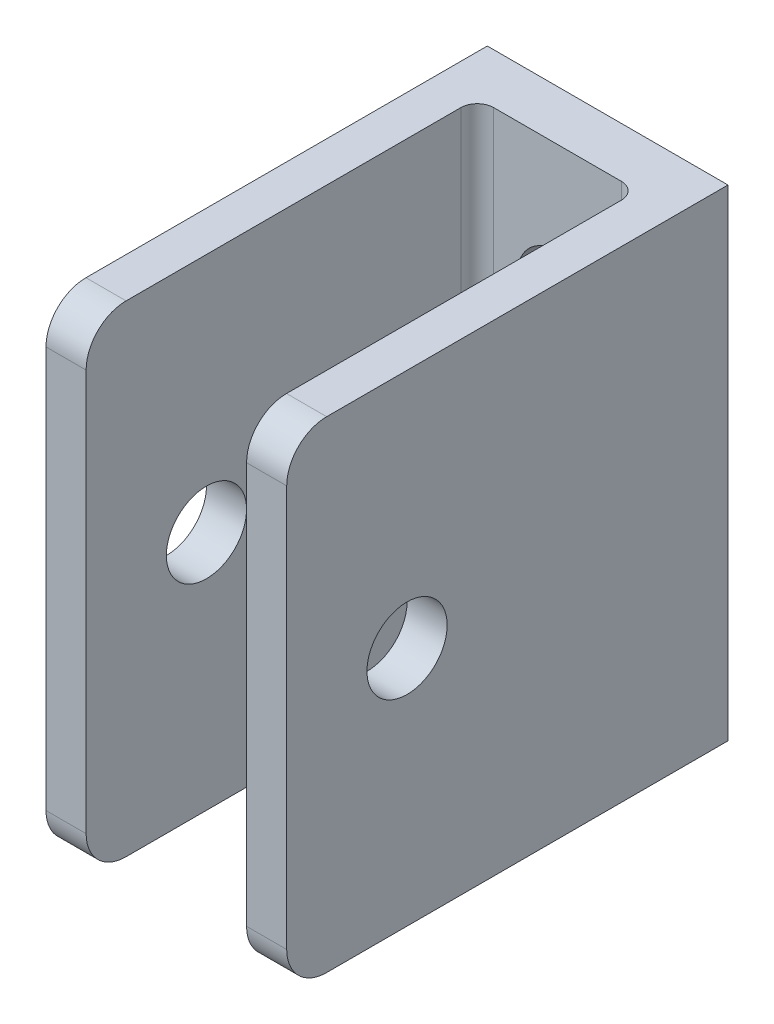
ISO-10303-21;
HEADER;
FILE_DESCRIPTION(('STEP AP214'),'2;1');
FILE_NAME('part.step','',(''),(''),'','','');
FILE_SCHEMA(('AUTOMOTIVE_DESIGN { 1 0 10303 214 1 1 1 1 }'));
ENDSEC;
DATA;
#1=APPLICATION_CONTEXT('core data for automotive mechanical design processes');
#2=APPLICATION_PROTOCOL_DEFINITION('international standard','automotive_design',2000,#1);
#3=PRODUCT_CONTEXT('',#1,'mechanical');
#4=PRODUCT('Part','Part','',(#3));
#5=PRODUCT_RELATED_PRODUCT_CATEGORY('part','',(#4));
#6=PRODUCT_DEFINITION_FORMATION('','',#4);
#7=PRODUCT_DEFINITION_CONTEXT('part definition',#1,'design');
#8=PRODUCT_DEFINITION('design','',#6,#7);
#9=PRODUCT_DEFINITION_SHAPE('','',#8);
#10=(LENGTH_UNIT() NAMED_UNIT(*) SI_UNIT(.MILLI.,.METRE.));
#11=(NAMED_UNIT(*) PLANE_ANGLE_UNIT() SI_UNIT($,.RADIAN.));
#12=(NAMED_UNIT(*) SI_UNIT($,.STERADIAN.) SOLID_ANGLE_UNIT());
#13=UNCERTAINTY_MEASURE_WITH_UNIT(LENGTH_MEASURE(1.E-05),#10,'distance_accuracy_value','');
#14=(GEOMETRIC_REPRESENTATION_CONTEXT(3) GLOBAL_UNCERTAINTY_ASSIGNED_CONTEXT((#13)) GLOBAL_UNIT_ASSIGNED_CONTEXT((#10,
#11,#12)) REPRESENTATION_CONTEXT('',''));
#15=CARTESIAN_POINT('',(0.,0.,0.));
#16=DIRECTION('',(0.,0.,1.));
#17=DIRECTION('',(1.,0.,0.));
#18=AXIS2_PLACEMENT_3D('',#15,#16,#17);
#19=CARTESIAN_POINT('',(9.525,19.05,0.));
#20=DIRECTION('',(-1.,0.,0.));
#21=DIRECTION('',(0.,0.,1.));
#22=AXIS2_PLACEMENT_3D('',#19,#20,#21);
#23=PLANE('',#22);
#24=DIRECTION('',(0.,-1.,0.));
#25=VECTOR('',#24,1.);
#26=CARTESIAN_POINT('',(9.525,19.05,34.925));
#27=LINE('',#26,#25);
#28=CARTESIAN_POINT('',(9.525,15.8877,34.925));
#29=VERTEX_POINT('',#28);
#30=CARTESIAN_POINT('',(9.525,-15.8877,34.925));
#31=VERTEX_POINT('',#30);
#32=EDGE_CURVE('E241',#29,#31,#27,.T.);
#33=ORIENTED_EDGE('',*,*,#32,.T.);
#34=CARTESIAN_POINT('',(9.525,-15.8877,31.7627));
#35=DIRECTION('',(-1.,0.,0.));
#36=DIRECTION('',(0.,0.,1.));
#37=AXIS2_PLACEMENT_3D('',#34,#35,#36);
#38=CIRCLE('',#37,3.1623);
#39=CARTESIAN_POINT('',(9.525,-19.05,31.7627));
#40=VERTEX_POINT('',#39);
#41=EDGE_CURVE('E186',#31,#40,#38,.F.);
#42=ORIENTED_EDGE('',*,*,#41,.T.);
#43=DIRECTION('',(0.,0.,-1.));
#44=VECTOR('',#43,1.);
#45=CARTESIAN_POINT('',(9.525,-19.05,0.));
#46=LINE('',#45,#44);
#47=CARTESIAN_POINT('',(9.525,-19.05,0.));
#48=VERTEX_POINT('',#47);
#49=EDGE_CURVE('E159',#40,#48,#46,.T.);
#50=ORIENTED_EDGE('',*,*,#49,.T.);
#51=DIRECTION('',(0.,-1.,0.));
#52=VECTOR('',#51,1.);
#53=CARTESIAN_POINT('',(9.525,19.05,0.));
#54=LINE('',#53,#52);
#55=CARTESIAN_POINT('',(9.525,19.05,0.));
#56=VERTEX_POINT('',#55);
#57=EDGE_CURVE('E150',#56,#48,#54,.T.);
#58=ORIENTED_EDGE('',*,*,#57,.F.);
#59=DIRECTION('',(0.,0.,-1.));
#60=VECTOR('',#59,1.);
#61=CARTESIAN_POINT('',(9.525,19.05,0.));
#62=LINE('',#61,#60);
#63=CARTESIAN_POINT('',(9.525,19.05,31.7627));
#64=VERTEX_POINT('',#63);
#65=EDGE_CURVE('E133',#64,#56,#62,.T.);
#66=ORIENTED_EDGE('',*,*,#65,.F.);
#67=CARTESIAN_POINT('',(9.525,15.8877,31.7627));
#68=DIRECTION('',(-1.,0.,0.));
#69=DIRECTION('',(0.,0.,1.));
#70=AXIS2_PLACEMENT_3D('',#67,#68,#69);
#71=CIRCLE('',#70,3.1623);
#72=EDGE_CURVE('E184',#64,#29,#71,.F.);
#73=ORIENTED_EDGE('',*,*,#72,.T.);
#74=EDGE_LOOP('',(#33,#42,#50,#58,#66,#73));
#75=FACE_BOUND('',#74,.T.);
#76=CARTESIAN_POINT('',(9.525,0.,25.4));
#77=DIRECTION('',(1.,0.,0.));
#78=DIRECTION('',(0.,0.,-1.));
#79=AXIS2_PLACEMENT_3D('',#76,#77,#78);
#80=CIRCLE('',#79,3.175);
#81=CARTESIAN_POINT('',(9.525,0.,22.225));
#82=VERTEX_POINT('',#81);
#83=EDGE_CURVE('E180',#82,#82,#80,.T.);
#84=ORIENTED_EDGE('',*,*,#83,.F.);
#85=EDGE_LOOP('',(#84));
#86=FACE_BOUND('',#85,.T.);
#87=ADVANCED_FACE('F32',(#75,#86),#23,.F.);
#88=CARTESIAN_POINT('',(-9.52499999999999,19.05,34.925));
#89=DIRECTION('',(1.,0.,0.));
#90=DIRECTION('',(0.,0.,-1.));
#91=AXIS2_PLACEMENT_3D('',#88,#89,#90);
#92=PLANE('',#91);
#93=DIRECTION('',(0.,0.,1.));
#94=VECTOR('',#93,1.);
#95=CARTESIAN_POINT('',(-9.52499999999999,-19.05,34.925));
#96=LINE('',#95,#94);
#97=CARTESIAN_POINT('',(-9.525,-19.05,0.));
#98=VERTEX_POINT('',#97);
#99=CARTESIAN_POINT('',(-9.52499999999999,-19.05,31.7627));
#100=VERTEX_POINT('',#99);
#101=EDGE_CURVE('E254',#98,#100,#96,.T.);
#102=ORIENTED_EDGE('',*,*,#101,.T.);
#103=CARTESIAN_POINT('',(-9.52499999999999,-15.8877,31.7627));
#104=DIRECTION('',(1.,0.,0.));
#105=DIRECTION('',(0.,0.,-1.));
#106=AXIS2_PLACEMENT_3D('',#103,#104,#105);
#107=CIRCLE('',#106,3.1623);
#108=CARTESIAN_POINT('',(-9.52499999999999,-15.8877,34.925));
#109=VERTEX_POINT('',#108);
#110=EDGE_CURVE('E213',#100,#109,#107,.F.);
#111=ORIENTED_EDGE('',*,*,#110,.T.);
#112=DIRECTION('',(0.,-1.,0.));
#113=VECTOR('',#112,1.);
#114=CARTESIAN_POINT('',(-9.52499999999999,19.05,34.925));
#115=LINE('',#114,#113);
#116=CARTESIAN_POINT('',(-9.52499999999999,15.8877,34.925));
#117=VERTEX_POINT('',#116);
#118=EDGE_CURVE('E165',#117,#109,#115,.T.);
#119=ORIENTED_EDGE('',*,*,#118,.F.);
#120=CARTESIAN_POINT('',(-9.52499999999999,15.8877,31.7627));
#121=DIRECTION('',(1.,0.,0.));
#122=DIRECTION('',(0.,0.,-1.));
#123=AXIS2_PLACEMENT_3D('',#120,#121,#122);
#124=CIRCLE('',#123,3.1623);
#125=CARTESIAN_POINT('',(-9.52499999999999,19.05,31.7627));
#126=VERTEX_POINT('',#125);
#127=EDGE_CURVE('E211',#117,#126,#124,.F.);
#128=ORIENTED_EDGE('',*,*,#127,.T.);
#129=DIRECTION('',(0.,0.,1.));
#130=VECTOR('',#129,1.);
#131=CARTESIAN_POINT('',(-9.52499999999999,19.05,34.925));
#132=LINE('',#131,#130);
#133=CARTESIAN_POINT('',(-9.525,19.05,0.));
#134=VERTEX_POINT('',#133);
#135=EDGE_CURVE('E154',#134,#126,#132,.T.);
#136=ORIENTED_EDGE('',*,*,#135,.F.);
#137=DIRECTION('',(0.,-1.,0.));
#138=VECTOR('',#137,1.);
#139=CARTESIAN_POINT('',(-9.525,19.05,0.));
#140=LINE('',#139,#138);
#141=EDGE_CURVE('E152',#134,#98,#140,.T.);
#142=ORIENTED_EDGE('',*,*,#141,.T.);
#143=EDGE_LOOP('',(#102,#111,#119,#128,#136,#142));
#144=FACE_BOUND('',#143,.T.);
#145=CARTESIAN_POINT('',(-9.525,0.,25.4));
#146=DIRECTION('',(1.,0.,0.));
#147=DIRECTION('',(0.,0.,-1.));
#148=AXIS2_PLACEMENT_3D('',#145,#146,#147);
#149=CIRCLE('',#148,3.175);
#150=CARTESIAN_POINT('',(-9.525,0.,22.225));
#151=VERTEX_POINT('',#150);
#152=EDGE_CURVE('E299',#151,#151,#149,.T.);
#153=ORIENTED_EDGE('',*,*,#152,.T.);
#154=EDGE_LOOP('',(#153));
#155=FACE_BOUND('',#154,.T.);
#156=ADVANCED_FACE('F281',(#144,#155),#92,.F.);
#157=CARTESIAN_POINT('',(-6.35,19.05,3.96875));
#158=DIRECTION('',(-1.,0.,0.));
#159=DIRECTION('',(0.,0.,1.));
#160=AXIS2_PLACEMENT_3D('',#157,#158,#159);
#161=PLANE('',#160);
#162=DIRECTION('',(0.,0.,-1.));
#163=VECTOR('',#162,1.);
#164=CARTESIAN_POINT('',(-6.35,-19.05,3.96875));
#165=LINE('',#164,#163);
#166=CARTESIAN_POINT('',(-6.34999999999999,-19.05,31.7627));
#167=VERTEX_POINT('',#166);
#168=CARTESIAN_POINT('',(-6.35,-19.05,5.2705));
#169=VERTEX_POINT('',#168);
#170=EDGE_CURVE('E251',#167,#169,#165,.T.);
#171=ORIENTED_EDGE('',*,*,#170,.T.);
#172=DIRECTION('',(0.,-1.,0.));
#173=VECTOR('',#172,1.);
#174=CARTESIAN_POINT('',(-6.35,19.05,5.2705));
#175=LINE('',#174,#173);
#176=CARTESIAN_POINT('',(-6.35,19.05,5.2705));
#177=VERTEX_POINT('',#176);
#178=EDGE_CURVE('E47',#169,#177,#175,.F.);
#179=ORIENTED_EDGE('',*,*,#178,.T.);
#180=DIRECTION('',(0.,0.,-1.));
#181=VECTOR('',#180,1.);
#182=CARTESIAN_POINT('',(-6.35,19.05,3.96875));
#183=LINE('',#182,#181);
#184=CARTESIAN_POINT('',(-6.34999999999999,19.05,31.7627));
#185=VERTEX_POINT('',#184);
#186=EDGE_CURVE('E288',#185,#177,#183,.T.);
#187=ORIENTED_EDGE('',*,*,#186,.F.);
#188=CARTESIAN_POINT('',(-6.34999999999999,15.8877,31.7627));
#189=DIRECTION('',(-1.,0.,0.));
#190=DIRECTION('',(0.,0.,1.));
#191=AXIS2_PLACEMENT_3D('',#188,#189,#190);
#192=CIRCLE('',#191,3.1623);
#193=CARTESIAN_POINT('',(-6.34999999999999,15.8877,34.925));
#194=VERTEX_POINT('',#193);
#195=EDGE_CURVE('E207',#185,#194,#192,.F.);
#196=ORIENTED_EDGE('',*,*,#195,.T.);
#197=DIRECTION('',(0.,-1.,0.));
#198=VECTOR('',#197,1.);
#199=CARTESIAN_POINT('',(-6.34999999999999,19.05,34.925));
#200=LINE('',#199,#198);
#201=CARTESIAN_POINT('',(-6.34999999999999,-15.8877,34.925));
#202=VERTEX_POINT('',#201);
#203=EDGE_CURVE('E262',#194,#202,#200,.T.);
#204=ORIENTED_EDGE('',*,*,#203,.T.);
#205=CARTESIAN_POINT('',(-6.34999999999999,-15.8877,31.7627));
#206=DIRECTION('',(-1.,0.,0.));
#207=DIRECTION('',(0.,0.,1.));
#208=AXIS2_PLACEMENT_3D('',#205,#206,#207);
#209=CIRCLE('',#208,3.1623);
#210=EDGE_CURVE('E209',#202,#167,#209,.F.);
#211=ORIENTED_EDGE('',*,*,#210,.T.);
#212=EDGE_LOOP('',(#171,#179,#187,#196,#204,#211));
#213=FACE_BOUND('',#212,.T.);
#214=CARTESIAN_POINT('',(-6.34999999999999,0.,25.4));
#215=DIRECTION('',(-1.,0.,0.));
#216=DIRECTION('',(0.,0.,1.));
#217=AXIS2_PLACEMENT_3D('',#214,#215,#216);
#218=CIRCLE('',#217,3.175);
#219=CARTESIAN_POINT('',(-6.34999999999999,0.,28.575));
#220=VERTEX_POINT('',#219);
#221=EDGE_CURVE('E179',#220,#220,#218,.F.);
#222=ORIENTED_EDGE('',*,*,#221,.F.);
#223=EDGE_LOOP('',(#222));
#224=FACE_BOUND('',#223,.T.);
#225=ADVANCED_FACE('F277',(#213,#224),#161,.F.);
#226=CARTESIAN_POINT('',(6.34999999999999,19.05,34.925));
#227=DIRECTION('',(1.,0.,0.));
#228=DIRECTION('',(0.,0.,-1.));
#229=AXIS2_PLACEMENT_3D('',#226,#227,#228);
#230=PLANE('',#229);
#231=DIRECTION('',(0.,0.,1.));
#232=VECTOR('',#231,1.);
#233=CARTESIAN_POINT('',(6.34999999999999,19.05,34.925));
#234=LINE('',#233,#232);
#235=CARTESIAN_POINT('',(6.35,19.05,5.2705));
#236=VERTEX_POINT('',#235);
#237=CARTESIAN_POINT('',(6.34999999999999,19.05,31.7627));
#238=VERTEX_POINT('',#237);
#239=EDGE_CURVE('E229',#236,#238,#234,.T.);
#240=ORIENTED_EDGE('',*,*,#239,.F.);
#241=DIRECTION('',(0.,-1.,0.));
#242=VECTOR('',#241,1.);
#243=CARTESIAN_POINT('',(6.35,-19.05,5.2705));
#244=LINE('',#243,#242);
#245=CARTESIAN_POINT('',(6.35,-19.05,5.2705));
#246=VERTEX_POINT('',#245);
#247=EDGE_CURVE('E215',#236,#246,#244,.T.);
#248=ORIENTED_EDGE('',*,*,#247,.T.);
#249=DIRECTION('',(0.,0.,1.));
#250=VECTOR('',#249,1.);
#251=CARTESIAN_POINT('',(6.34999999999999,-19.05,34.925));
#252=LINE('',#251,#250);
#253=CARTESIAN_POINT('',(6.34999999999999,-19.05,31.7627));
#254=VERTEX_POINT('',#253);
#255=EDGE_CURVE('E144',#246,#254,#252,.T.);
#256=ORIENTED_EDGE('',*,*,#255,.T.);
#257=CARTESIAN_POINT('',(6.34999999999999,-15.8877,31.7627));
#258=DIRECTION('',(1.,0.,0.));
#259=DIRECTION('',(0.,0.,-1.));
#260=AXIS2_PLACEMENT_3D('',#257,#258,#259);
#261=CIRCLE('',#260,3.1623);
#262=CARTESIAN_POINT('',(6.34999999999999,-15.8877,34.925));
#263=VERTEX_POINT('',#262);
#264=EDGE_CURVE('E196',#254,#263,#261,.F.);
#265=ORIENTED_EDGE('',*,*,#264,.T.);
#266=DIRECTION('',(0.,-1.,0.));
#267=VECTOR('',#266,1.);
#268=CARTESIAN_POINT('',(6.34999999999999,19.05,34.925));
#269=LINE('',#268,#267);
#270=CARTESIAN_POINT('',(6.34999999999999,15.8877,34.925));
#271=VERTEX_POINT('',#270);
#272=EDGE_CURVE('E259',#271,#263,#269,.T.);
#273=ORIENTED_EDGE('',*,*,#272,.F.);
#274=CARTESIAN_POINT('',(6.34999999999999,15.8877,31.7627));
#275=DIRECTION('',(1.,0.,0.));
#276=DIRECTION('',(0.,0.,-1.));
#277=AXIS2_PLACEMENT_3D('',#274,#275,#276);
#278=CIRCLE('',#277,3.1623);
#279=EDGE_CURVE('E193',#271,#238,#278,.F.);
#280=ORIENTED_EDGE('',*,*,#279,.T.);
#281=EDGE_LOOP('',(#240,#248,#256,#265,#273,#280));
#282=FACE_BOUND('',#281,.T.);
#283=CARTESIAN_POINT('',(6.34999999999999,0.,25.4));
#284=DIRECTION('',(1.,0.,0.));
#285=DIRECTION('',(0.,0.,-1.));
#286=AXIS2_PLACEMENT_3D('',#283,#284,#285);
#287=CIRCLE('',#286,3.175);
#288=CARTESIAN_POINT('',(6.34999999999999,0.,22.225));
#289=VERTEX_POINT('',#288);
#290=EDGE_CURVE('E177',#289,#289,#287,.F.);
#291=ORIENTED_EDGE('',*,*,#290,.F.);
#292=EDGE_LOOP('',(#291));
#293=FACE_BOUND('',#292,.T.);
#294=ADVANCED_FACE('F236',(#282,#293),#230,.F.);
#295=CARTESIAN_POINT('',(-9.525,19.05,0.));
#296=DIRECTION('',(0.,0.,1.));
#297=DIRECTION('',(1.,0.,0.));
#298=AXIS2_PLACEMENT_3D('',#295,#296,#297);
#299=PLANE('',#298);
#300=CARTESIAN_POINT('',(0.,8.5725,0.));
#301=DIRECTION('',(0.,0.,1.));
#302=DIRECTION('',(1.,0.,0.));
#303=AXIS2_PLACEMENT_3D('',#300,#301,#302);
#304=CIRCLE('',#303,3.175);
#305=CARTESIAN_POINT('',(3.175,8.5725,0.));
#306=VERTEX_POINT('',#305);
#307=EDGE_CURVE('E172',#306,#306,#304,.T.);
#308=ORIENTED_EDGE('',*,*,#307,.T.);
#309=EDGE_LOOP('',(#308));
#310=FACE_BOUND('',#309,.T.);
#311=DIRECTION('',(-1.,0.,0.));
#312=VECTOR('',#311,1.);
#313=CARTESIAN_POINT('',(-9.525,-19.05,0.));
#314=LINE('',#313,#312);
#315=EDGE_CURVE('E283',#48,#98,#314,.T.);
#316=ORIENTED_EDGE('',*,*,#315,.T.);
#317=ORIENTED_EDGE('',*,*,#141,.F.);
#318=DIRECTION('',(-1.,0.,0.));
#319=VECTOR('',#318,1.);
#320=CARTESIAN_POINT('',(-9.525,19.05,0.));
#321=LINE('',#320,#319);
#322=EDGE_CURVE('E138',#56,#134,#321,.T.);
#323=ORIENTED_EDGE('',*,*,#322,.F.);
#324=ORIENTED_EDGE('',*,*,#57,.T.);
#325=EDGE_LOOP('',(#316,#317,#323,#324));
#326=FACE_BOUND('',#325,.T.);
#327=CARTESIAN_POINT('',(0.,-8.5725,0.));
#328=DIRECTION('',(0.,0.,1.));
#329=DIRECTION('',(1.,0.,0.));
#330=AXIS2_PLACEMENT_3D('',#327,#328,#329);
#331=CIRCLE('',#330,3.175);
#332=CARTESIAN_POINT('',(3.175,-8.5725,0.));
#333=VERTEX_POINT('',#332);
#334=EDGE_CURVE('E176',#333,#333,#331,.T.);
#335=ORIENTED_EDGE('',*,*,#334,.T.);
#336=EDGE_LOOP('',(#335));
#337=FACE_BOUND('',#336,.T.);
#338=ADVANCED_FACE('F148',(#310,#326,#337),#299,.F.);
#339=CARTESIAN_POINT('',(6.35,19.05,3.96875));
#340=DIRECTION('',(0.,0.,-1.));
#341=DIRECTION('',(-1.,0.,0.));
#342=AXIS2_PLACEMENT_3D('',#339,#340,#341);
#343=PLANE('',#342);
#344=CARTESIAN_POINT('',(0.,8.5725,3.96875));
#345=DIRECTION('',(0.,0.,-1.));
#346=DIRECTION('',(-1.,0.,0.));
#347=AXIS2_PLACEMENT_3D('',#344,#345,#346);
#348=CIRCLE('',#347,3.175);
#349=CARTESIAN_POINT('',(-3.175,8.5725,3.96875));
#350=VERTEX_POINT('',#349);
#351=EDGE_CURVE('E169',#350,#350,#348,.F.);
#352=ORIENTED_EDGE('',*,*,#351,.F.);
#353=EDGE_LOOP('',(#352));
#354=FACE_BOUND('',#353,.T.);
#355=DIRECTION('',(1.,0.,0.));
#356=VECTOR('',#355,1.);
#357=CARTESIAN_POINT('',(6.35,-19.05,3.96875));
#358=LINE('',#357,#356);
#359=CARTESIAN_POINT('',(-5.04825,-19.05,3.96875));
#360=VERTEX_POINT('',#359);
#361=CARTESIAN_POINT('',(5.04825,-19.05,3.96875));
#362=VERTEX_POINT('',#361);
#363=EDGE_CURVE('E246',#360,#362,#358,.T.);
#364=ORIENTED_EDGE('',*,*,#363,.T.);
#365=DIRECTION('',(0.,-1.,0.));
#366=VECTOR('',#365,1.);
#367=CARTESIAN_POINT('',(5.04825,19.05,3.96875));
#368=LINE('',#367,#366);
#369=CARTESIAN_POINT('',(5.04825,19.05,3.96875));
#370=VERTEX_POINT('',#369);
#371=EDGE_CURVE('E221',#362,#370,#368,.F.);
#372=ORIENTED_EDGE('',*,*,#371,.T.);
#373=DIRECTION('',(1.,0.,0.));
#374=VECTOR('',#373,1.);
#375=CARTESIAN_POINT('',(6.35,19.05,3.96875));
#376=LINE('',#375,#374);
#377=CARTESIAN_POINT('',(-5.04825,19.05,3.96875));
#378=VERTEX_POINT('',#377);
#379=EDGE_CURVE('E231',#378,#370,#376,.T.);
#380=ORIENTED_EDGE('',*,*,#379,.F.);
#381=DIRECTION('',(0.,-1.,0.));
#382=VECTOR('',#381,1.);
#383=CARTESIAN_POINT('',(-5.04825,-19.05,3.96875));
#384=LINE('',#383,#382);
#385=EDGE_CURVE('E218',#378,#360,#384,.T.);
#386=ORIENTED_EDGE('',*,*,#385,.T.);
#387=EDGE_LOOP('',(#364,#372,#380,#386));
#388=FACE_BOUND('',#387,.T.);
#389=CARTESIAN_POINT('',(0.,-8.5725,3.96875));
#390=DIRECTION('',(0.,0.,-1.));
#391=DIRECTION('',(-1.,0.,0.));
#392=AXIS2_PLACEMENT_3D('',#389,#390,#391);
#393=CIRCLE('',#392,3.175);
#394=CARTESIAN_POINT('',(-3.175,-8.5725,3.96875));
#395=VERTEX_POINT('',#394);
#396=EDGE_CURVE('E173',#395,#395,#393,.F.);
#397=ORIENTED_EDGE('',*,*,#396,.F.);
#398=EDGE_LOOP('',(#397));
#399=FACE_BOUND('',#398,.T.);
#400=ADVANCED_FACE('F248',(#354,#388,#399),#343,.F.);
#401=CARTESIAN_POINT('',(-6.34999999999999,19.05,34.925));
#402=DIRECTION('',(0.,0.,-1.));
#403=DIRECTION('',(-1.,0.,0.));
#404=AXIS2_PLACEMENT_3D('',#401,#402,#403);
#405=PLANE('',#404);
#406=ORIENTED_EDGE('',*,*,#118,.T.);
#407=DIRECTION('',(1.,0.,0.));
#408=VECTOR('',#407,1.);
#409=CARTESIAN_POINT('',(-6.34999999999999,-15.8877,34.925));
#410=LINE('',#409,#408);
#411=EDGE_CURVE('E204',#109,#202,#410,.T.);
#412=ORIENTED_EDGE('',*,*,#411,.T.);
#413=ORIENTED_EDGE('',*,*,#203,.F.);
#414=DIRECTION('',(1.,0.,0.));
#415=VECTOR('',#414,1.);
#416=CARTESIAN_POINT('',(-6.34999999999999,15.8877,34.925));
#417=LINE('',#416,#415);
#418=EDGE_CURVE('E202',#194,#117,#417,.F.);
#419=ORIENTED_EDGE('',*,*,#418,.T.);
#420=EDGE_LOOP('',(#406,#412,#413,#419));
#421=FACE_BOUND('',#420,.T.);
#422=ADVANCED_FACE('F268',(#421),#405,.F.);
#423=CARTESIAN_POINT('',(9.525,19.05,34.925));
#424=DIRECTION('',(0.,0.,-1.));
#425=DIRECTION('',(-1.,0.,0.));
#426=AXIS2_PLACEMENT_3D('',#423,#424,#425);
#427=PLANE('',#426);
#428=ORIENTED_EDGE('',*,*,#272,.T.);
#429=DIRECTION('',(1.,0.,0.));
#430=VECTOR('',#429,1.);
#431=CARTESIAN_POINT('',(9.525,-15.8877,34.925));
#432=LINE('',#431,#430);
#433=EDGE_CURVE('E163',#263,#31,#432,.T.);
#434=ORIENTED_EDGE('',*,*,#433,.T.);
#435=ORIENTED_EDGE('',*,*,#32,.F.);
#436=DIRECTION('',(1.,0.,0.));
#437=VECTOR('',#436,1.);
#438=CARTESIAN_POINT('',(9.525,15.8877,34.925));
#439=LINE('',#438,#437);
#440=EDGE_CURVE('E161',#29,#271,#439,.F.);
#441=ORIENTED_EDGE('',*,*,#440,.T.);
#442=EDGE_LOOP('',(#428,#434,#435,#441));
#443=FACE_BOUND('',#442,.T.);
#444=ADVANCED_FACE('F372',(#443),#427,.F.);
#445=CARTESIAN_POINT('',(9.525,19.05,34.925));
#446=DIRECTION('',(0.,-1.,0.));
#447=DIRECTION('',(0.,0.,-1.));
#448=AXIS2_PLACEMENT_3D('',#445,#446,#447);
#449=PLANE('',#448);
#450=ORIENTED_EDGE('',*,*,#379,.T.);
#451=CARTESIAN_POINT('',(5.04825,19.05,5.2705));
#452=DIRECTION('',(0.,-1.,0.));
#453=DIRECTION('',(0.,0.,-1.));
#454=AXIS2_PLACEMENT_3D('',#451,#452,#453);
#455=CIRCLE('',#454,1.30175);
#456=EDGE_CURVE('E226',#370,#236,#455,.T.);
#457=ORIENTED_EDGE('',*,*,#456,.T.);
#458=ORIENTED_EDGE('',*,*,#239,.T.);
#459=DIRECTION('',(1.,0.,0.));
#460=VECTOR('',#459,1.);
#461=CARTESIAN_POINT('',(9.525,19.05,31.7627));
#462=LINE('',#461,#460);
#463=EDGE_CURVE('E141',#238,#64,#462,.T.);
#464=ORIENTED_EDGE('',*,*,#463,.T.);
#465=ORIENTED_EDGE('',*,*,#65,.T.);
#466=ORIENTED_EDGE('',*,*,#322,.T.);
#467=ORIENTED_EDGE('',*,*,#135,.T.);
#468=DIRECTION('',(1.,0.,0.));
#469=VECTOR('',#468,1.);
#470=CARTESIAN_POINT('',(9.525,19.05,31.7627));
#471=LINE('',#470,#469);
#472=EDGE_CURVE('E198',#126,#185,#471,.T.);
#473=ORIENTED_EDGE('',*,*,#472,.T.);
#474=ORIENTED_EDGE('',*,*,#186,.T.);
#475=CARTESIAN_POINT('',(-5.04825,19.05,5.2705));
#476=DIRECTION('',(0.,-1.,0.));
#477=DIRECTION('',(0.,0.,-1.));
#478=AXIS2_PLACEMENT_3D('',#475,#476,#477);
#479=CIRCLE('',#478,1.30175);
#480=EDGE_CURVE('E11',#177,#378,#479,.T.);
#481=ORIENTED_EDGE('',*,*,#480,.T.);
#482=EDGE_LOOP('',(#450,#457,#458,#464,#465,#466,#467,#473,#474,#481));
#483=FACE_BOUND('',#482,.T.);
#484=ADVANCED_FACE('F136',(#483),#449,.F.);
#485=CARTESIAN_POINT('',(9.525,-19.05,34.925));
#486=DIRECTION('',(0.,-1.,0.));
#487=DIRECTION('',(0.,0.,-1.));
#488=AXIS2_PLACEMENT_3D('',#485,#486,#487);
#489=PLANE('',#488);
#490=ORIENTED_EDGE('',*,*,#49,.F.);
#491=DIRECTION('',(1.,0.,0.));
#492=VECTOR('',#491,1.);
#493=CARTESIAN_POINT('',(6.34999999999999,-19.05,31.7627));
#494=LINE('',#493,#492);
#495=EDGE_CURVE('E190',#40,#254,#494,.F.);
#496=ORIENTED_EDGE('',*,*,#495,.T.);
#497=ORIENTED_EDGE('',*,*,#255,.F.);
#498=CARTESIAN_POINT('',(5.04825,-19.05,5.2705));
#499=DIRECTION('',(0.,-1.,0.));
#500=DIRECTION('',(0.,0.,-1.));
#501=AXIS2_PLACEMENT_3D('',#498,#499,#500);
#502=CIRCLE('',#501,1.30175);
#503=EDGE_CURVE('E224',#246,#362,#502,.F.);
#504=ORIENTED_EDGE('',*,*,#503,.T.);
#505=ORIENTED_EDGE('',*,*,#363,.F.);
#506=CARTESIAN_POINT('',(-5.04825,-19.05,5.2705));
#507=DIRECTION('',(0.,-1.,0.));
#508=DIRECTION('',(0.,0.,-1.));
#509=AXIS2_PLACEMENT_3D('',#506,#507,#508);
#510=CIRCLE('',#509,1.30175);
#511=EDGE_CURVE('E40',#360,#169,#510,.F.);
#512=ORIENTED_EDGE('',*,*,#511,.T.);
#513=ORIENTED_EDGE('',*,*,#170,.F.);
#514=DIRECTION('',(1.,0.,0.));
#515=VECTOR('',#514,1.);
#516=CARTESIAN_POINT('',(-9.52499999999999,-19.05,31.7627));
#517=LINE('',#516,#515);
#518=EDGE_CURVE('E188',#167,#100,#517,.F.);
#519=ORIENTED_EDGE('',*,*,#518,.T.);
#520=ORIENTED_EDGE('',*,*,#101,.F.);
#521=ORIENTED_EDGE('',*,*,#315,.F.);
#522=EDGE_LOOP('',(#490,#496,#497,#504,#505,#512,#513,#519,#520,#521));
#523=FACE_BOUND('',#522,.T.);
#524=ADVANCED_FACE('F245',(#523),#489,.T.);
#525=CARTESIAN_POINT('',(0.,8.5725,34.925));
#526=DIRECTION('',(0.,0.,-1.));
#527=DIRECTION('',(-1.,0.,0.));
#528=AXIS2_PLACEMENT_3D('',#525,#526,#527);
#529=CYLINDRICAL_SURFACE('',#528,3.175);
#530=ORIENTED_EDGE('',*,*,#307,.F.);
#531=EDGE_LOOP('',(#530));
#532=FACE_BOUND('',#531,.T.);
#533=ORIENTED_EDGE('',*,*,#351,.T.);
#534=EDGE_LOOP('',(#533));
#535=FACE_BOUND('',#534,.T.);
#536=ADVANCED_FACE('F361',(#532,#535),#529,.F.);
#537=CARTESIAN_POINT('',(0.,-8.5725,34.925));
#538=DIRECTION('',(0.,0.,-1.));
#539=DIRECTION('',(-1.,0.,0.));
#540=AXIS2_PLACEMENT_3D('',#537,#538,#539);
#541=CYLINDRICAL_SURFACE('',#540,3.175);
#542=ORIENTED_EDGE('',*,*,#334,.F.);
#543=EDGE_LOOP('',(#542));
#544=FACE_BOUND('',#543,.T.);
#545=ORIENTED_EDGE('',*,*,#396,.T.);
#546=EDGE_LOOP('',(#545));
#547=FACE_BOUND('',#546,.T.);
#548=ADVANCED_FACE('F456',(#544,#547),#541,.F.);
#549=CARTESIAN_POINT('',(9.525,0.,25.4));
#550=DIRECTION('',(-1.,0.,0.));
#551=DIRECTION('',(0.,0.,1.));
#552=AXIS2_PLACEMENT_3D('',#549,#550,#551);
#553=CYLINDRICAL_SURFACE('',#552,3.175);
#554=ORIENTED_EDGE('',*,*,#83,.T.);
#555=EDGE_LOOP('',(#554));
#556=FACE_BOUND('',#555,.T.);
#557=ORIENTED_EDGE('',*,*,#290,.T.);
#558=EDGE_LOOP('',(#557));
#559=FACE_BOUND('',#558,.T.);
#560=ADVANCED_FACE('F307',(#556,#559),#553,.F.);
#561=ORIENTED_EDGE('',*,*,#152,.F.);
#562=EDGE_LOOP('',(#561));
#563=FACE_BOUND('',#562,.T.);
#564=ORIENTED_EDGE('',*,*,#221,.T.);
#565=EDGE_LOOP('',(#564));
#566=FACE_BOUND('',#565,.T.);
#567=ADVANCED_FACE('F303',(#563,#566),#553,.F.);
#568=CARTESIAN_POINT('',(9.525,-15.8877,31.7627));
#569=DIRECTION('',(-1.,0.,0.));
#570=DIRECTION('',(0.,0.,1.));
#571=AXIS2_PLACEMENT_3D('',#568,#569,#570);
#572=CYLINDRICAL_SURFACE('',#571,3.1623);
#573=ORIENTED_EDGE('',*,*,#264,.F.);
#574=ORIENTED_EDGE('',*,*,#495,.F.);
#575=ORIENTED_EDGE('',*,*,#41,.F.);
#576=ORIENTED_EDGE('',*,*,#433,.F.);
#577=EDGE_LOOP('',(#573,#574,#575,#576));
#578=FACE_BOUND('',#577,.T.);
#579=ADVANCED_FACE('F306',(#578),#572,.T.);
#580=CARTESIAN_POINT('',(9.525,15.8877,31.7627));
#581=DIRECTION('',(1.,0.,0.));
#582=DIRECTION('',(0.,0.,-1.));
#583=AXIS2_PLACEMENT_3D('',#580,#581,#582);
#584=CYLINDRICAL_SURFACE('',#583,3.1623);
#585=ORIENTED_EDGE('',*,*,#279,.F.);
#586=ORIENTED_EDGE('',*,*,#440,.F.);
#587=ORIENTED_EDGE('',*,*,#72,.F.);
#588=ORIENTED_EDGE('',*,*,#463,.F.);
#589=EDGE_LOOP('',(#585,#586,#587,#588));
#590=FACE_BOUND('',#589,.T.);
#591=ADVANCED_FACE('F328',(#590),#584,.T.);
#592=CARTESIAN_POINT('',(-6.34999999999999,-15.8877,31.7627));
#593=DIRECTION('',(-1.,0.,0.));
#594=DIRECTION('',(0.,0.,1.));
#595=AXIS2_PLACEMENT_3D('',#592,#593,#594);
#596=CYLINDRICAL_SURFACE('',#595,3.1623);
#597=ORIENTED_EDGE('',*,*,#110,.F.);
#598=ORIENTED_EDGE('',*,*,#518,.F.);
#599=ORIENTED_EDGE('',*,*,#210,.F.);
#600=ORIENTED_EDGE('',*,*,#411,.F.);
#601=EDGE_LOOP('',(#597,#598,#599,#600));
#602=FACE_BOUND('',#601,.T.);
#603=ADVANCED_FACE('F275',(#602),#596,.T.);
#604=CARTESIAN_POINT('',(9.525,15.8877,31.7627));
#605=DIRECTION('',(1.,0.,0.));
#606=DIRECTION('',(0.,0.,-1.));
#607=AXIS2_PLACEMENT_3D('',#604,#605,#606);
#608=CYLINDRICAL_SURFACE('',#607,3.1623);
#609=ORIENTED_EDGE('',*,*,#127,.F.);
#610=ORIENTED_EDGE('',*,*,#418,.F.);
#611=ORIENTED_EDGE('',*,*,#195,.F.);
#612=ORIENTED_EDGE('',*,*,#472,.F.);
#613=EDGE_LOOP('',(#609,#610,#611,#612));
#614=FACE_BOUND('',#613,.T.);
#615=ADVANCED_FACE('F335',(#614),#608,.T.);
#616=CARTESIAN_POINT('',(5.04825,19.05,5.2705));
#617=DIRECTION('',(0.,1.,0.));
#618=DIRECTION('',(0.,0.,1.));
#619=AXIS2_PLACEMENT_3D('',#616,#617,#618);
#620=CYLINDRICAL_SURFACE('',#619,1.30175);
#621=ORIENTED_EDGE('',*,*,#456,.F.);
#622=ORIENTED_EDGE('',*,*,#371,.F.);
#623=ORIENTED_EDGE('',*,*,#503,.F.);
#624=ORIENTED_EDGE('',*,*,#247,.F.);
#625=EDGE_LOOP('',(#621,#622,#623,#624));
#626=FACE_BOUND('',#625,.T.);
#627=ADVANCED_FACE('F243',(#626),#620,.F.);
#628=CARTESIAN_POINT('',(-5.04825,19.05,5.2705));
#629=DIRECTION('',(0.,1.,0.));
#630=DIRECTION('',(0.,0.,1.));
#631=AXIS2_PLACEMENT_3D('',#628,#629,#630);
#632=CYLINDRICAL_SURFACE('',#631,1.30175);
#633=ORIENTED_EDGE('',*,*,#480,.F.);
#634=ORIENTED_EDGE('',*,*,#178,.F.);
#635=ORIENTED_EDGE('',*,*,#511,.F.);
#636=ORIENTED_EDGE('',*,*,#385,.F.);
#637=EDGE_LOOP('',(#633,#634,#635,#636));
#638=FACE_BOUND('',#637,.T.);
#639=ADVANCED_FACE('F34',(#638),#632,.F.);
#640=CLOSED_SHELL('',(#87,#156,#225,#294,#338,#400,#422,#444,#484,#524,#536,#548,#560,#567,#579,
#591,#603,#615,#627,#639));
#641=MANIFOLD_SOLID_BREP('B2',#640);
#642=ADVANCED_BREP_SHAPE_REPRESENTATION('',(#18,#641),#14);
#643=SHAPE_DEFINITION_REPRESENTATION(#9,#642);
ENDSEC;
END-ISO-10303-21;
